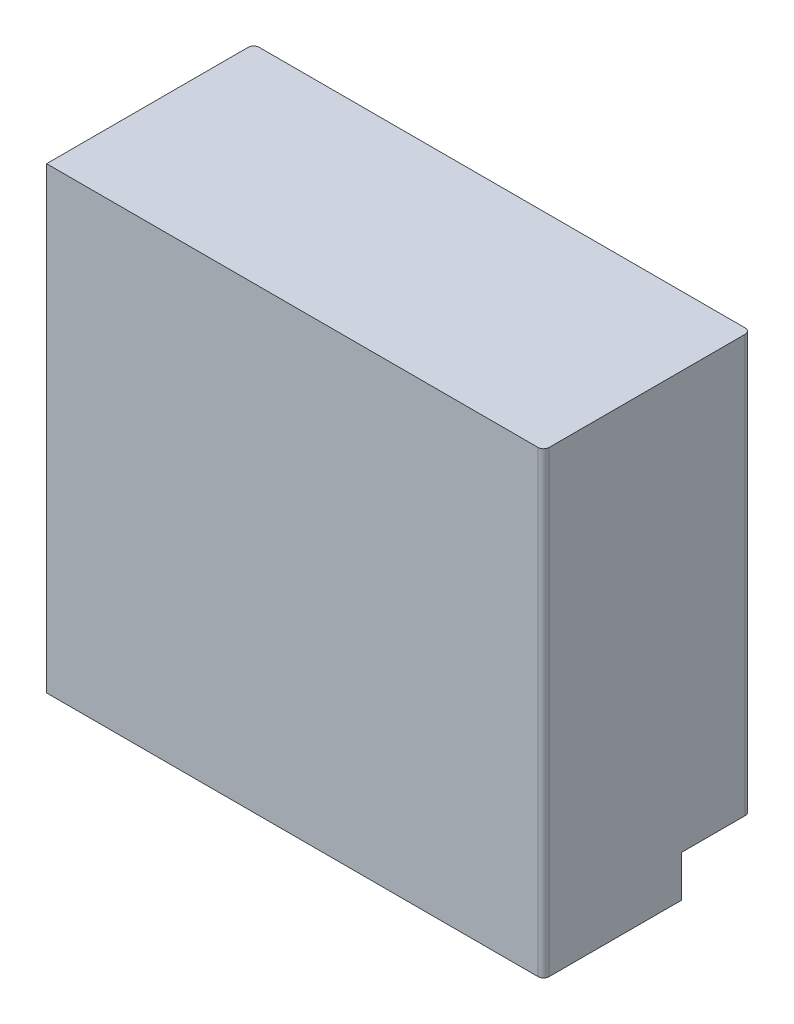
ISO-10303-21;
HEADER;
FILE_DESCRIPTION(('STEP AP214'),'2;1');
FILE_NAME('part.step','',(''),(''),'','','');
FILE_SCHEMA(('AUTOMOTIVE_DESIGN { 1 0 10303 214 1 1 1 1 }'));
ENDSEC;
DATA;
#1=APPLICATION_CONTEXT('core data for automotive mechanical design processes');
#2=APPLICATION_PROTOCOL_DEFINITION('international standard','automotive_design',2000,#1);
#3=PRODUCT_CONTEXT('',#1,'mechanical');
#4=PRODUCT('Part','Part','',(#3));
#5=PRODUCT_RELATED_PRODUCT_CATEGORY('part','',(#4));
#6=PRODUCT_DEFINITION_FORMATION('','',#4);
#7=PRODUCT_DEFINITION_CONTEXT('part definition',#1,'design');
#8=PRODUCT_DEFINITION('design','',#6,#7);
#9=PRODUCT_DEFINITION_SHAPE('','',#8);
#10=(LENGTH_UNIT() NAMED_UNIT(*) SI_UNIT(.MILLI.,.METRE.));
#11=(NAMED_UNIT(*) PLANE_ANGLE_UNIT() SI_UNIT($,.RADIAN.));
#12=(NAMED_UNIT(*) SI_UNIT($,.STERADIAN.) SOLID_ANGLE_UNIT());
#13=UNCERTAINTY_MEASURE_WITH_UNIT(LENGTH_MEASURE(1.E-05),#10,'distance_accuracy_value','');
#14=(GEOMETRIC_REPRESENTATION_CONTEXT(3) GLOBAL_UNCERTAINTY_ASSIGNED_CONTEXT((#13)) GLOBAL_UNIT_ASSIGNED_CONTEXT((#10,
#11,#12)) REPRESENTATION_CONTEXT('',''));
#15=CARTESIAN_POINT('',(0.,0.,0.));
#16=DIRECTION('',(0.,0.,1.));
#17=DIRECTION('',(1.,0.,0.));
#18=AXIS2_PLACEMENT_3D('',#15,#16,#17);
#19=CARTESIAN_POINT('',(0.,15.,0.));
#20=DIRECTION('',(0.,1.,0.));
#21=DIRECTION('',(0.,0.,1.));
#22=AXIS2_PLACEMENT_3D('',#19,#20,#21);
#23=PLANE('',#22);
#24=DIRECTION('',(1.,0.,0.));
#25=VECTOR('',#24,1.);
#26=CARTESIAN_POINT('',(90.,15.,-37.5));
#27=LINE('',#26,#25);
#28=CARTESIAN_POINT('',(40.,15.,-37.5));
#29=VERTEX_POINT('',#28);
#30=CARTESIAN_POINT('',(88.,15.,-37.5));
#31=VERTEX_POINT('',#30);
#32=EDGE_CURVE('E272',#29,#31,#27,.T.);
#33=ORIENTED_EDGE('',*,*,#32,.T.);
#34=CARTESIAN_POINT('',(88.,15.,-35.5));
#35=DIRECTION('',(0.,1.,0.));
#36=DIRECTION('',(0.,0.,1.));
#37=AXIS2_PLACEMENT_3D('',#34,#35,#36);
#38=CIRCLE('',#37,2.);
#39=CARTESIAN_POINT('',(90.,15.,-35.5));
#40=VERTEX_POINT('',#39);
#41=EDGE_CURVE('E375',#31,#40,#38,.F.);
#42=ORIENTED_EDGE('',*,*,#41,.T.);
#43=DIRECTION('',(0.,0.,1.));
#44=VECTOR('',#43,1.);
#45=CARTESIAN_POINT('',(90.,15.,-37.5));
#46=LINE('',#45,#44);
#47=CARTESIAN_POINT('',(90.,15.,-12.5));
#48=VERTEX_POINT('',#47);
#49=EDGE_CURVE('E275',#40,#48,#46,.T.);
#50=ORIENTED_EDGE('',*,*,#49,.T.);
#51=DIRECTION('',(-1.,0.,0.));
#52=VECTOR('',#51,1.);
#53=CARTESIAN_POINT('',(90.,15.,-12.5));
#54=LINE('',#53,#52);
#55=CARTESIAN_POINT('',(40.,15.,-12.5));
#56=VERTEX_POINT('',#55);
#57=EDGE_CURVE('E278',#48,#56,#54,.T.);
#58=ORIENTED_EDGE('',*,*,#57,.T.);
#59=DIRECTION('',(0.,0.,-1.));
#60=VECTOR('',#59,1.);
#61=CARTESIAN_POINT('',(40.,15.,-37.5));
#62=LINE('',#61,#60);
#63=EDGE_CURVE('E281',#56,#29,#62,.T.);
#64=ORIENTED_EDGE('',*,*,#63,.T.);
#65=EDGE_LOOP('',(#33,#42,#50,#58,#64));
#66=FACE_BOUND('',#65,.T.);
#67=DIRECTION('',(0.,0.,1.));
#68=VECTOR('',#67,1.);
#69=CARTESIAN_POINT('',(74.,15.,-17.5));
#70=LINE('',#69,#68);
#71=CARTESIAN_POINT('',(74.,15.,-32.4999999999999));
#72=VERTEX_POINT('',#71);
#73=CARTESIAN_POINT('',(74.,15.,-17.5));
#74=VERTEX_POINT('',#73);
#75=EDGE_CURVE('E213',#72,#74,#70,.T.);
#76=ORIENTED_EDGE('',*,*,#75,.F.);
#77=DIRECTION('',(1.,0.,0.));
#78=VECTOR('',#77,1.);
#79=CARTESIAN_POINT('',(74.,15.,-32.4999999999999));
#80=LINE('',#79,#78);
#81=CARTESIAN_POINT('',(70.,15.,-32.4999999999999));
#82=VERTEX_POINT('',#81);
#83=EDGE_CURVE('E225',#82,#72,#80,.T.);
#84=ORIENTED_EDGE('',*,*,#83,.F.);
#85=DIRECTION('',(0.,0.,-1.));
#86=VECTOR('',#85,1.);
#87=CARTESIAN_POINT('',(70.,15.,-17.5));
#88=LINE('',#87,#86);
#89=CARTESIAN_POINT('',(70.,15.,-17.5));
#90=VERTEX_POINT('',#89);
#91=EDGE_CURVE('E233',#90,#82,#88,.T.);
#92=ORIENTED_EDGE('',*,*,#91,.F.);
#93=DIRECTION('',(-1.,0.,0.));
#94=VECTOR('',#93,1.);
#95=CARTESIAN_POINT('',(74.,15.,-17.5));
#96=LINE('',#95,#94);
#97=EDGE_CURVE('E228',#74,#90,#96,.T.);
#98=ORIENTED_EDGE('',*,*,#97,.F.);
#99=EDGE_LOOP('',(#76,#84,#92,#98));
#100=FACE_BOUND('',#99,.T.);
#101=ADVANCED_FACE('F35',(#66,#100),#23,.F.);
#102=CARTESIAN_POINT('',(0.,15.,0.));
#103=DIRECTION('',(0.,1.,0.));
#104=DIRECTION('',(0.,0.,1.));
#105=AXIS2_PLACEMENT_3D('',#102,#103,#104);
#106=PLANE('',#105);
#107=DIRECTION('',(0.,0.,-1.));
#108=VECTOR('',#107,1.);
#109=CARTESIAN_POINT('',(-90.,15.,-37.5));
#110=LINE('',#109,#108);
#111=CARTESIAN_POINT('',(-90.,15.,-12.5));
#112=VERTEX_POINT('',#111);
#113=CARTESIAN_POINT('',(-90.,15.,-35.5));
#114=VERTEX_POINT('',#113);
#115=EDGE_CURVE('E297',#112,#114,#110,.T.);
#116=ORIENTED_EDGE('',*,*,#115,.T.);
#117=CARTESIAN_POINT('',(-88.,15.,-35.5));
#118=DIRECTION('',(0.,1.,0.));
#119=DIRECTION('',(0.,0.,1.));
#120=AXIS2_PLACEMENT_3D('',#117,#118,#119);
#121=CIRCLE('',#120,2.);
#122=CARTESIAN_POINT('',(-88.,15.,-37.5));
#123=VERTEX_POINT('',#122);
#124=EDGE_CURVE('E373',#114,#123,#121,.F.);
#125=ORIENTED_EDGE('',*,*,#124,.T.);
#126=DIRECTION('',(1.,0.,0.));
#127=VECTOR('',#126,1.);
#128=CARTESIAN_POINT('',(-90.,15.,-37.5));
#129=LINE('',#128,#127);
#130=CARTESIAN_POINT('',(-40.,15.,-37.5));
#131=VERTEX_POINT('',#130);
#132=EDGE_CURVE('E300',#123,#131,#129,.T.);
#133=ORIENTED_EDGE('',*,*,#132,.T.);
#134=DIRECTION('',(0.,0.,1.));
#135=VECTOR('',#134,1.);
#136=CARTESIAN_POINT('',(-40.,15.,-37.5));
#137=LINE('',#136,#135);
#138=CARTESIAN_POINT('',(-40.,15.,-12.5));
#139=VERTEX_POINT('',#138);
#140=EDGE_CURVE('E303',#131,#139,#137,.T.);
#141=ORIENTED_EDGE('',*,*,#140,.T.);
#142=DIRECTION('',(-1.,0.,0.));
#143=VECTOR('',#142,1.);
#144=CARTESIAN_POINT('',(-90.,15.,-12.5));
#145=LINE('',#144,#143);
#146=EDGE_CURVE('E306',#139,#112,#145,.T.);
#147=ORIENTED_EDGE('',*,*,#146,.T.);
#148=EDGE_LOOP('',(#116,#125,#133,#141,#147));
#149=FACE_BOUND('',#148,.T.);
#150=DIRECTION('',(0.,0.,-1.));
#151=VECTOR('',#150,1.);
#152=CARTESIAN_POINT('',(-74.,15.,-17.5));
#153=LINE('',#152,#151);
#154=CARTESIAN_POINT('',(-74.,15.,-17.5));
#155=VERTEX_POINT('',#154);
#156=CARTESIAN_POINT('',(-74.,15.,-32.5));
#157=VERTEX_POINT('',#156);
#158=EDGE_CURVE('E245',#155,#157,#153,.T.);
#159=ORIENTED_EDGE('',*,*,#158,.F.);
#160=DIRECTION('',(-1.,0.,0.));
#161=VECTOR('',#160,1.);
#162=CARTESIAN_POINT('',(-74.,15.,-17.5));
#163=LINE('',#162,#161);
#164=CARTESIAN_POINT('',(-70.,15.,-17.5));
#165=VERTEX_POINT('',#164);
#166=EDGE_CURVE('E250',#165,#155,#163,.T.);
#167=ORIENTED_EDGE('',*,*,#166,.F.);
#168=DIRECTION('',(0.,0.,1.));
#169=VECTOR('',#168,1.);
#170=CARTESIAN_POINT('',(-70.,15.,-17.5));
#171=LINE('',#170,#169);
#172=CARTESIAN_POINT('',(-70.,15.,-32.5));
#173=VERTEX_POINT('',#172);
#174=EDGE_CURVE('E259',#173,#165,#171,.T.);
#175=ORIENTED_EDGE('',*,*,#174,.F.);
#176=DIRECTION('',(1.,0.,0.));
#177=VECTOR('',#176,1.);
#178=CARTESIAN_POINT('',(-74.,15.,-32.5));
#179=LINE('',#178,#177);
#180=EDGE_CURVE('E256',#157,#173,#179,.T.);
#181=ORIENTED_EDGE('',*,*,#180,.F.);
#182=EDGE_LOOP('',(#159,#167,#175,#181));
#183=FACE_BOUND('',#182,.T.);
#184=ADVANCED_FACE('F421',(#149,#183),#106,.F.);
#185=CARTESIAN_POINT('',(-90.,166.,-37.5));
#186=DIRECTION('',(1.,0.,0.));
#187=DIRECTION('',(0.,0.,-1.));
#188=AXIS2_PLACEMENT_3D('',#185,#186,#187);
#189=PLANE('',#188);
#190=DIRECTION('',(0.,0.,1.));
#191=VECTOR('',#190,1.);
#192=CARTESIAN_POINT('',(-90.,166.,-37.5));
#193=LINE('',#192,#191);
#194=CARTESIAN_POINT('',(-90.,166.,-35.5));
#195=VERTEX_POINT('',#194);
#196=CARTESIAN_POINT('',(-90.,166.,37.5));
#197=VERTEX_POINT('',#196);
#198=EDGE_CURVE('E321',#195,#197,#193,.T.);
#199=ORIENTED_EDGE('',*,*,#198,.F.);
#200=DIRECTION('',(0.,-1.,0.));
#201=VECTOR('',#200,1.);
#202=CARTESIAN_POINT('',(-90.,166.,-35.5));
#203=LINE('',#202,#201);
#204=EDGE_CURVE('E370',#195,#114,#203,.T.);
#205=ORIENTED_EDGE('',*,*,#204,.T.);
#206=ORIENTED_EDGE('',*,*,#115,.F.);
#207=DIRECTION('',(0.,-1.,0.));
#208=VECTOR('',#207,1.);
#209=CARTESIAN_POINT('',(-90.,15.,-12.5));
#210=LINE('',#209,#208);
#211=CARTESIAN_POINT('',(-90.,0.,-12.5));
#212=VERTEX_POINT('',#211);
#213=EDGE_CURVE('E312',#112,#212,#210,.T.);
#214=ORIENTED_EDGE('',*,*,#213,.T.);
#215=DIRECTION('',(0.,0.,1.));
#216=VECTOR('',#215,1.);
#217=CARTESIAN_POINT('',(-90.,0.,-37.5));
#218=LINE('',#217,#216);
#219=CARTESIAN_POINT('',(-90.,0.,37.5));
#220=VERTEX_POINT('',#219);
#221=EDGE_CURVE('E315',#212,#220,#218,.T.);
#222=ORIENTED_EDGE('',*,*,#221,.T.);
#223=DIRECTION('',(0.,-1.,0.));
#224=VECTOR('',#223,1.);
#225=CARTESIAN_POINT('',(-90.,166.,37.5));
#226=LINE('',#225,#224);
#227=EDGE_CURVE('E333',#197,#220,#226,.T.);
#228=ORIENTED_EDGE('',*,*,#227,.F.);
#229=EDGE_LOOP('',(#199,#205,#206,#214,#222,#228));
#230=FACE_BOUND('',#229,.T.);
#231=ADVANCED_FACE('F440',(#230),#189,.F.);
#232=CARTESIAN_POINT('',(90.,166.,37.5));
#233=DIRECTION('',(0.,0.,-1.));
#234=DIRECTION('',(-1.,0.,0.));
#235=AXIS2_PLACEMENT_3D('',#232,#233,#234);
#236=PLANE('',#235);
#237=DIRECTION('',(1.,0.,0.));
#238=VECTOR('',#237,1.);
#239=CARTESIAN_POINT('',(90.,0.,37.5));
#240=LINE('',#239,#238);
#241=CARTESIAN_POINT('',(88.,0.,37.5));
#242=VERTEX_POINT('',#241);
#243=EDGE_CURVE('E335',#220,#242,#240,.T.);
#244=ORIENTED_EDGE('',*,*,#243,.T.);
#245=DIRECTION('',(0.,-1.,0.));
#246=VECTOR('',#245,1.);
#247=CARTESIAN_POINT('',(88.,166.,37.5));
#248=LINE('',#247,#246);
#249=CARTESIAN_POINT('',(88.,166.,37.5));
#250=VERTEX_POINT('',#249);
#251=EDGE_CURVE('E350',#242,#250,#248,.F.);
#252=ORIENTED_EDGE('',*,*,#251,.T.);
#253=DIRECTION('',(1.,0.,0.));
#254=VECTOR('',#253,1.);
#255=CARTESIAN_POINT('',(90.,166.,37.5));
#256=LINE('',#255,#254);
#257=EDGE_CURVE('E323',#197,#250,#256,.T.);
#258=ORIENTED_EDGE('',*,*,#257,.F.);
#259=ORIENTED_EDGE('',*,*,#227,.T.);
#260=EDGE_LOOP('',(#244,#252,#258,#259));
#261=FACE_BOUND('',#260,.T.);
#262=ADVANCED_FACE('F478',(#261),#236,.F.);
#263=CARTESIAN_POINT('',(90.,166.,-37.5));
#264=DIRECTION('',(-1.,0.,0.));
#265=DIRECTION('',(0.,0.,1.));
#266=AXIS2_PLACEMENT_3D('',#263,#264,#265);
#267=PLANE('',#266);
#268=DIRECTION('',(0.,0.,-1.));
#269=VECTOR('',#268,1.);
#270=CARTESIAN_POINT('',(90.,166.,-37.5));
#271=LINE('',#270,#269);
#272=CARTESIAN_POINT('',(90.,166.,35.5));
#273=VERTEX_POINT('',#272);
#274=CARTESIAN_POINT('',(90.,166.,-35.5));
#275=VERTEX_POINT('',#274);
#276=EDGE_CURVE('E327',#273,#275,#271,.T.);
#277=ORIENTED_EDGE('',*,*,#276,.F.);
#278=DIRECTION('',(0.,-1.,0.));
#279=VECTOR('',#278,1.);
#280=CARTESIAN_POINT('',(90.,166.,35.5));
#281=LINE('',#280,#279);
#282=CARTESIAN_POINT('',(90.,0.,35.5));
#283=VERTEX_POINT('',#282);
#284=EDGE_CURVE('E343',#273,#283,#281,.T.);
#285=ORIENTED_EDGE('',*,*,#284,.T.);
#286=DIRECTION('',(0.,0.,-1.));
#287=VECTOR('',#286,1.);
#288=CARTESIAN_POINT('',(90.,0.,-37.5));
#289=LINE('',#288,#287);
#290=CARTESIAN_POINT('',(90.,0.,-12.5));
#291=VERTEX_POINT('',#290);
#292=EDGE_CURVE('E324',#283,#291,#289,.T.);
#293=ORIENTED_EDGE('',*,*,#292,.T.);
#294=DIRECTION('',(0.,-1.,0.));
#295=VECTOR('',#294,1.);
#296=CARTESIAN_POINT('',(90.,15.,-12.5));
#297=LINE('',#296,#295);
#298=EDGE_CURVE('E284',#48,#291,#297,.T.);
#299=ORIENTED_EDGE('',*,*,#298,.F.);
#300=ORIENTED_EDGE('',*,*,#49,.F.);
#301=DIRECTION('',(0.,-1.,0.));
#302=VECTOR('',#301,1.);
#303=CARTESIAN_POINT('',(90.,166.,-35.5));
#304=LINE('',#303,#302);
#305=EDGE_CURVE('E341',#40,#275,#304,.F.);
#306=ORIENTED_EDGE('',*,*,#305,.T.);
#307=EDGE_LOOP('',(#277,#285,#293,#299,#300,#306));
#308=FACE_BOUND('',#307,.T.);
#309=ADVANCED_FACE('F474',(#308),#267,.F.);
#310=CARTESIAN_POINT('',(90.,166.,-37.5));
#311=DIRECTION('',(0.,0.,1.));
#312=DIRECTION('',(1.,0.,0.));
#313=AXIS2_PLACEMENT_3D('',#310,#311,#312);
#314=PLANE('',#313);
#315=DIRECTION('',(0.,-1.,0.));
#316=VECTOR('',#315,1.);
#317=CARTESIAN_POINT('',(40.,15.,-37.5));
#318=LINE('',#317,#316);
#319=CARTESIAN_POINT('',(40.,2.,-37.5));
#320=VERTEX_POINT('',#319);
#321=EDGE_CURVE('E289',#29,#320,#318,.T.);
#322=ORIENTED_EDGE('',*,*,#321,.T.);
#323=DIRECTION('',(-1.,0.,0.));
#324=VECTOR('',#323,1.);
#325=CARTESIAN_POINT('',(-40.,2.,-37.5));
#326=LINE('',#325,#324);
#327=CARTESIAN_POINT('',(-40.,2.,-37.5));
#328=VERTEX_POINT('',#327);
#329=EDGE_CURVE('E363',#320,#328,#326,.T.);
#330=ORIENTED_EDGE('',*,*,#329,.T.);
#331=DIRECTION('',(0.,-1.,0.));
#332=VECTOR('',#331,1.);
#333=CARTESIAN_POINT('',(-40.,15.,-37.5));
#334=LINE('',#333,#332);
#335=EDGE_CURVE('E309',#131,#328,#334,.T.);
#336=ORIENTED_EDGE('',*,*,#335,.F.);
#337=ORIENTED_EDGE('',*,*,#132,.F.);
#338=DIRECTION('',(0.,-1.,0.));
#339=VECTOR('',#338,1.);
#340=CARTESIAN_POINT('',(-88.,166.,-37.5));
#341=LINE('',#340,#339);
#342=CARTESIAN_POINT('',(-87.9999999999999,166.,-37.5));
#343=VERTEX_POINT('',#342);
#344=EDGE_CURVE('E361',#123,#343,#341,.F.);
#345=ORIENTED_EDGE('',*,*,#344,.T.);
#346=DIRECTION('',(-1.,0.,0.));
#347=VECTOR('',#346,1.);
#348=CARTESIAN_POINT('',(90.,166.,-37.5));
#349=LINE('',#348,#347);
#350=CARTESIAN_POINT('',(88.,166.,-37.5));
#351=VERTEX_POINT('',#350);
#352=EDGE_CURVE('E330',#351,#343,#349,.T.);
#353=ORIENTED_EDGE('',*,*,#352,.F.);
#354=DIRECTION('',(0.,-1.,0.));
#355=VECTOR('',#354,1.);
#356=CARTESIAN_POINT('',(88.,166.,-37.5));
#357=LINE('',#356,#355);
#358=EDGE_CURVE('E358',#351,#31,#357,.T.);
#359=ORIENTED_EDGE('',*,*,#358,.T.);
#360=ORIENTED_EDGE('',*,*,#32,.F.);
#361=EDGE_LOOP('',(#322,#330,#336,#337,#345,#353,#359,#360));
#362=FACE_BOUND('',#361,.T.);
#363=ADVANCED_FACE('F467',(#362),#314,.F.);
#364=CARTESIAN_POINT('',(0.,166.,0.));
#365=DIRECTION('',(0.,-1.,0.));
#366=DIRECTION('',(0.,0.,-1.));
#367=AXIS2_PLACEMENT_3D('',#364,#365,#366);
#368=PLANE('',#367);
#369=ORIENTED_EDGE('',*,*,#257,.T.);
#370=CARTESIAN_POINT('',(88.,166.,35.5));
#371=DIRECTION('',(0.,-1.,0.));
#372=DIRECTION('',(0.,0.,-1.));
#373=AXIS2_PLACEMENT_3D('',#370,#371,#372);
#374=CIRCLE('',#373,2.);
#375=EDGE_CURVE('E356',#250,#273,#374,.F.);
#376=ORIENTED_EDGE('',*,*,#375,.T.);
#377=ORIENTED_EDGE('',*,*,#276,.T.);
#378=CARTESIAN_POINT('',(88.,166.,-35.5));
#379=DIRECTION('',(0.,-1.,0.));
#380=DIRECTION('',(0.,0.,-1.));
#381=AXIS2_PLACEMENT_3D('',#378,#379,#380);
#382=CIRCLE('',#381,2.);
#383=EDGE_CURVE('E352',#275,#351,#382,.F.);
#384=ORIENTED_EDGE('',*,*,#383,.T.);
#385=ORIENTED_EDGE('',*,*,#352,.T.);
#386=CARTESIAN_POINT('',(-88.,166.,-35.5));
#387=DIRECTION('',(0.,-1.,0.));
#388=DIRECTION('',(0.,0.,-1.));
#389=AXIS2_PLACEMENT_3D('',#386,#387,#388);
#390=CIRCLE('',#389,2.);
#391=EDGE_CURVE('E354',#343,#195,#390,.F.);
#392=ORIENTED_EDGE('',*,*,#391,.T.);
#393=ORIENTED_EDGE('',*,*,#198,.T.);
#394=EDGE_LOOP('',(#369,#376,#377,#384,#385,#392,#393));
#395=FACE_BOUND('',#394,.T.);
#396=ADVANCED_FACE('F464',(#395),#368,.F.);
#397=CARTESIAN_POINT('',(0.,0.,0.));
#398=DIRECTION('',(0.,-1.,0.));
#399=DIRECTION('',(0.,0.,-1.));
#400=AXIS2_PLACEMENT_3D('',#397,#398,#399);
#401=PLANE('',#400);
#402=ORIENTED_EDGE('',*,*,#292,.F.);
#403=CARTESIAN_POINT('',(88.,0.,35.5));
#404=DIRECTION('',(0.,-1.,0.));
#405=DIRECTION('',(0.,0.,-1.));
#406=AXIS2_PLACEMENT_3D('',#403,#404,#405);
#407=CIRCLE('',#406,2.);
#408=EDGE_CURVE('E348',#283,#242,#407,.T.);
#409=ORIENTED_EDGE('',*,*,#408,.T.);
#410=ORIENTED_EDGE('',*,*,#243,.F.);
#411=ORIENTED_EDGE('',*,*,#221,.F.);
#412=DIRECTION('',(-1.,0.,0.));
#413=VECTOR('',#412,1.);
#414=CARTESIAN_POINT('',(-90.,0.,-12.5));
#415=LINE('',#414,#413);
#416=CARTESIAN_POINT('',(-40.,0.,-12.5));
#417=VERTEX_POINT('',#416);
#418=EDGE_CURVE('E301',#417,#212,#415,.T.);
#419=ORIENTED_EDGE('',*,*,#418,.F.);
#420=DIRECTION('',(0.,0.,1.));
#421=VECTOR('',#420,1.);
#422=CARTESIAN_POINT('',(-40.,0.,-37.5));
#423=LINE('',#422,#421);
#424=CARTESIAN_POINT('',(-40.,0.,-35.5));
#425=VERTEX_POINT('',#424);
#426=EDGE_CURVE('E292',#425,#417,#423,.T.);
#427=ORIENTED_EDGE('',*,*,#426,.F.);
#428=DIRECTION('',(-1.,0.,0.));
#429=VECTOR('',#428,1.);
#430=CARTESIAN_POINT('',(40.,0.,-35.5));
#431=LINE('',#430,#429);
#432=CARTESIAN_POINT('',(40.,0.,-35.5));
#433=VERTEX_POINT('',#432);
#434=EDGE_CURVE('E346',#425,#433,#431,.F.);
#435=ORIENTED_EDGE('',*,*,#434,.T.);
#436=DIRECTION('',(0.,0.,-1.));
#437=VECTOR('',#436,1.);
#438=CARTESIAN_POINT('',(40.,0.,-37.5));
#439=LINE('',#438,#437);
#440=CARTESIAN_POINT('',(40.,0.,-12.5));
#441=VERTEX_POINT('',#440);
#442=EDGE_CURVE('E276',#441,#433,#439,.T.);
#443=ORIENTED_EDGE('',*,*,#442,.F.);
#444=DIRECTION('',(-1.,0.,0.));
#445=VECTOR('',#444,1.);
#446=CARTESIAN_POINT('',(90.,0.,-12.5));
#447=LINE('',#446,#445);
#448=EDGE_CURVE('E271',#291,#441,#447,.T.);
#449=ORIENTED_EDGE('',*,*,#448,.F.);
#450=EDGE_LOOP('',(#402,#409,#410,#411,#419,#427,#435,#443,#449));
#451=FACE_BOUND('',#450,.T.);
#452=ADVANCED_FACE('F459',(#451),#401,.T.);
#453=CARTESIAN_POINT('',(-90.,15.,-12.5));
#454=DIRECTION('',(0.,0.,1.));
#455=DIRECTION('',(1.,0.,0.));
#456=AXIS2_PLACEMENT_3D('',#453,#454,#455);
#457=PLANE('',#456);
#458=ORIENTED_EDGE('',*,*,#418,.T.);
#459=ORIENTED_EDGE('',*,*,#213,.F.);
#460=ORIENTED_EDGE('',*,*,#146,.F.);
#461=DIRECTION('',(0.,-1.,0.));
#462=VECTOR('',#461,1.);
#463=CARTESIAN_POINT('',(-40.,15.,-12.5));
#464=LINE('',#463,#462);
#465=EDGE_CURVE('E316',#139,#417,#464,.T.);
#466=ORIENTED_EDGE('',*,*,#465,.T.);
#467=EDGE_LOOP('',(#458,#459,#460,#466));
#468=FACE_BOUND('',#467,.T.);
#469=ADVANCED_FACE('F456',(#468),#457,.F.);
#470=CARTESIAN_POINT('',(-40.,15.,-37.5));
#471=DIRECTION('',(1.,0.,0.));
#472=DIRECTION('',(0.,0.,-1.));
#473=AXIS2_PLACEMENT_3D('',#470,#471,#472);
#474=PLANE('',#473);
#475=ORIENTED_EDGE('',*,*,#335,.T.);
#476=CARTESIAN_POINT('',(-40.,2.,-35.5));
#477=DIRECTION('',(1.,0.,0.));
#478=DIRECTION('',(0.,0.,-1.));
#479=AXIS2_PLACEMENT_3D('',#476,#477,#478);
#480=CIRCLE('',#479,2.);
#481=EDGE_CURVE('E366',#328,#425,#480,.F.);
#482=ORIENTED_EDGE('',*,*,#481,.T.);
#483=ORIENTED_EDGE('',*,*,#426,.T.);
#484=ORIENTED_EDGE('',*,*,#465,.F.);
#485=ORIENTED_EDGE('',*,*,#140,.F.);
#486=EDGE_LOOP('',(#475,#482,#483,#484,#485));
#487=FACE_BOUND('',#486,.T.);
#488=ADVANCED_FACE('F450',(#487),#474,.F.);
#489=CARTESIAN_POINT('',(40.,15.,-37.5));
#490=DIRECTION('',(-1.,0.,0.));
#491=DIRECTION('',(0.,0.,1.));
#492=AXIS2_PLACEMENT_3D('',#489,#490,#491);
#493=PLANE('',#492);
#494=ORIENTED_EDGE('',*,*,#442,.T.);
#495=CARTESIAN_POINT('',(40.,2.,-35.5));
#496=DIRECTION('',(-1.,0.,0.));
#497=DIRECTION('',(0.,0.,1.));
#498=AXIS2_PLACEMENT_3D('',#495,#496,#497);
#499=CIRCLE('',#498,2.);
#500=EDGE_CURVE('E368',#433,#320,#499,.F.);
#501=ORIENTED_EDGE('',*,*,#500,.T.);
#502=ORIENTED_EDGE('',*,*,#321,.F.);
#503=ORIENTED_EDGE('',*,*,#63,.F.);
#504=DIRECTION('',(0.,-1.,0.));
#505=VECTOR('',#504,1.);
#506=CARTESIAN_POINT('',(40.,15.,-12.5));
#507=LINE('',#506,#505);
#508=EDGE_CURVE('E293',#56,#441,#507,.T.);
#509=ORIENTED_EDGE('',*,*,#508,.T.);
#510=EDGE_LOOP('',(#494,#501,#502,#503,#509));
#511=FACE_BOUND('',#510,.T.);
#512=ADVANCED_FACE('F446',(#511),#493,.F.);
#513=CARTESIAN_POINT('',(90.,15.,-12.5));
#514=DIRECTION('',(0.,0.,1.));
#515=DIRECTION('',(1.,0.,0.));
#516=AXIS2_PLACEMENT_3D('',#513,#514,#515);
#517=PLANE('',#516);
#518=ORIENTED_EDGE('',*,*,#448,.T.);
#519=ORIENTED_EDGE('',*,*,#508,.F.);
#520=ORIENTED_EDGE('',*,*,#57,.F.);
#521=ORIENTED_EDGE('',*,*,#298,.T.);
#522=EDGE_LOOP('',(#518,#519,#520,#521));
#523=FACE_BOUND('',#522,.T.);
#524=ADVANCED_FACE('F449',(#523),#517,.F.);
#525=CARTESIAN_POINT('',(88.,166.,35.5));
#526=DIRECTION('',(0.,-1.,0.));
#527=DIRECTION('',(0.,0.,-1.));
#528=AXIS2_PLACEMENT_3D('',#525,#526,#527);
#529=CYLINDRICAL_SURFACE('',#528,2.);
#530=ORIENTED_EDGE('',*,*,#375,.F.);
#531=ORIENTED_EDGE('',*,*,#251,.F.);
#532=ORIENTED_EDGE('',*,*,#408,.F.);
#533=ORIENTED_EDGE('',*,*,#284,.F.);
#534=EDGE_LOOP('',(#530,#531,#532,#533));
#535=FACE_BOUND('',#534,.T.);
#536=ADVANCED_FACE('F453',(#535),#529,.T.);
#537=CARTESIAN_POINT('',(90.,2.,-35.5));
#538=DIRECTION('',(1.,0.,0.));
#539=DIRECTION('',(0.,0.,-1.));
#540=AXIS2_PLACEMENT_3D('',#537,#538,#539);
#541=CYLINDRICAL_SURFACE('',#540,2.);
#542=ORIENTED_EDGE('',*,*,#500,.F.);
#543=ORIENTED_EDGE('',*,*,#434,.F.);
#544=ORIENTED_EDGE('',*,*,#481,.F.);
#545=ORIENTED_EDGE('',*,*,#329,.F.);
#546=EDGE_LOOP('',(#542,#543,#544,#545));
#547=FACE_BOUND('',#546,.T.);
#548=ADVANCED_FACE('F488',(#547),#541,.T.);
#549=CARTESIAN_POINT('',(-88.,166.,-35.5));
#550=DIRECTION('',(0.,-1.,0.));
#551=DIRECTION('',(0.,0.,-1.));
#552=AXIS2_PLACEMENT_3D('',#549,#550,#551);
#553=CYLINDRICAL_SURFACE('',#552,2.);
#554=ORIENTED_EDGE('',*,*,#391,.F.);
#555=ORIENTED_EDGE('',*,*,#344,.F.);
#556=ORIENTED_EDGE('',*,*,#124,.F.);
#557=ORIENTED_EDGE('',*,*,#204,.F.);
#558=EDGE_LOOP('',(#554,#555,#556,#557));
#559=FACE_BOUND('',#558,.T.);
#560=ADVANCED_FACE('F492',(#559),#553,.T.);
#561=CARTESIAN_POINT('',(88.,166.,-35.5));
#562=DIRECTION('',(0.,-1.,0.));
#563=DIRECTION('',(0.,0.,-1.));
#564=AXIS2_PLACEMENT_3D('',#561,#562,#563);
#565=CYLINDRICAL_SURFACE('',#564,2.);
#566=ORIENTED_EDGE('',*,*,#383,.F.);
#567=ORIENTED_EDGE('',*,*,#305,.F.);
#568=ORIENTED_EDGE('',*,*,#41,.F.);
#569=ORIENTED_EDGE('',*,*,#358,.F.);
#570=EDGE_LOOP('',(#566,#567,#568,#569));
#571=FACE_BOUND('',#570,.T.);
#572=ADVANCED_FACE('F496',(#571),#565,.T.);
#573=CARTESIAN_POINT('',(-74.,0.999999999999999,-17.5));
#574=DIRECTION('',(1.,0.,0.));
#575=DIRECTION('',(0.,0.,-1.));
#576=AXIS2_PLACEMENT_3D('',#573,#574,#575);
#577=PLANE('',#576);
#578=DIRECTION('',(0.,0.,-1.));
#579=VECTOR('',#578,1.);
#580=CARTESIAN_POINT('',(-74.,0.999999999999999,-17.5));
#581=LINE('',#580,#579);
#582=CARTESIAN_POINT('',(-74.,0.999999999999999,-21.5));
#583=VERTEX_POINT('',#582);
#584=CARTESIAN_POINT('',(-74.,0.999999999999999,-28.5));
#585=VERTEX_POINT('',#584);
#586=EDGE_CURVE('E246',#583,#585,#581,.T.);
#587=ORIENTED_EDGE('',*,*,#586,.F.);
#588=CARTESIAN_POINT('',(-74.,5.,-21.5));
#589=DIRECTION('',(1.,0.,0.));
#590=DIRECTION('',(0.,0.,-1.));
#591=AXIS2_PLACEMENT_3D('',#588,#589,#590);
#592=CIRCLE('',#591,4.);
#593=CARTESIAN_POINT('',(-74.,5.,-17.5));
#594=VERTEX_POINT('',#593);
#595=EDGE_CURVE('E402',#583,#594,#592,.F.);
#596=ORIENTED_EDGE('',*,*,#595,.T.);
#597=DIRECTION('',(0.,1.,0.));
#598=VECTOR('',#597,1.);
#599=CARTESIAN_POINT('',(-74.,0.999999999999999,-17.5));
#600=LINE('',#599,#598);
#601=EDGE_CURVE('E253',#594,#155,#600,.T.);
#602=ORIENTED_EDGE('',*,*,#601,.T.);
#603=ORIENTED_EDGE('',*,*,#158,.T.);
#604=DIRECTION('',(0.,1.,0.));
#605=VECTOR('',#604,1.);
#606=CARTESIAN_POINT('',(-74.,0.999999999999999,-32.5));
#607=LINE('',#606,#605);
#608=CARTESIAN_POINT('',(-74.,5.,-32.5));
#609=VERTEX_POINT('',#608);
#610=EDGE_CURVE('E269',#609,#157,#607,.T.);
#611=ORIENTED_EDGE('',*,*,#610,.F.);
#612=CARTESIAN_POINT('',(-74.,5.,-28.5));
#613=DIRECTION('',(1.,0.,0.));
#614=DIRECTION('',(0.,0.,-1.));
#615=AXIS2_PLACEMENT_3D('',#612,#613,#614);
#616=CIRCLE('',#615,4.);
#617=EDGE_CURVE('E400',#609,#585,#616,.F.);
#618=ORIENTED_EDGE('',*,*,#617,.T.);
#619=EDGE_LOOP('',(#587,#596,#602,#603,#611,#618));
#620=FACE_BOUND('',#619,.T.);
#621=ADVANCED_FACE('F415',(#620),#577,.F.);
#622=CARTESIAN_POINT('',(-74.,0.999999999999999,-32.5));
#623=DIRECTION('',(0.,0.,1.));
#624=DIRECTION('',(1.,0.,0.));
#625=AXIS2_PLACEMENT_3D('',#622,#623,#624);
#626=PLANE('',#625);
#627=DIRECTION('',(0.,1.,0.));
#628=VECTOR('',#627,1.);
#629=CARTESIAN_POINT('',(-70.,0.999999999999999,-32.5));
#630=LINE('',#629,#628);
#631=CARTESIAN_POINT('',(-70.,5.,-32.5));
#632=VERTEX_POINT('',#631);
#633=EDGE_CURVE('E267',#632,#173,#630,.T.);
#634=ORIENTED_EDGE('',*,*,#633,.F.);
#635=DIRECTION('',(1.,0.,0.));
#636=VECTOR('',#635,1.);
#637=CARTESIAN_POINT('',(-74.,5.,-32.5));
#638=LINE('',#637,#636);
#639=EDGE_CURVE('E11',#632,#609,#638,.F.);
#640=ORIENTED_EDGE('',*,*,#639,.T.);
#641=ORIENTED_EDGE('',*,*,#610,.T.);
#642=ORIENTED_EDGE('',*,*,#180,.T.);
#643=EDGE_LOOP('',(#634,#640,#641,#642));
#644=FACE_BOUND('',#643,.T.);
#645=ADVANCED_FACE('F425',(#644),#626,.F.);
#646=CARTESIAN_POINT('',(-70.,0.999999999999999,-17.5));
#647=DIRECTION('',(-1.,0.,0.));
#648=DIRECTION('',(0.,0.,1.));
#649=AXIS2_PLACEMENT_3D('',#646,#647,#648);
#650=PLANE('',#649);
#651=DIRECTION('',(0.,1.,0.));
#652=VECTOR('',#651,1.);
#653=CARTESIAN_POINT('',(-70.,0.999999999999999,-17.5));
#654=LINE('',#653,#652);
#655=CARTESIAN_POINT('',(-70.,5.,-17.5));
#656=VERTEX_POINT('',#655);
#657=EDGE_CURVE('E265',#656,#165,#654,.T.);
#658=ORIENTED_EDGE('',*,*,#657,.F.);
#659=CARTESIAN_POINT('',(-70.,5.,-21.5));
#660=DIRECTION('',(-1.,0.,0.));
#661=DIRECTION('',(0.,0.,1.));
#662=AXIS2_PLACEMENT_3D('',#659,#660,#661);
#663=CIRCLE('',#662,4.);
#664=CARTESIAN_POINT('',(-70.,0.999999999999999,-21.5));
#665=VERTEX_POINT('',#664);
#666=EDGE_CURVE('E43',#656,#665,#663,.F.);
#667=ORIENTED_EDGE('',*,*,#666,.T.);
#668=DIRECTION('',(0.,0.,1.));
#669=VECTOR('',#668,1.);
#670=CARTESIAN_POINT('',(-70.,0.999999999999999,-17.5));
#671=LINE('',#670,#669);
#672=CARTESIAN_POINT('',(-70.,0.999999999999999,-28.5));
#673=VERTEX_POINT('',#672);
#674=EDGE_CURVE('E249',#673,#665,#671,.T.);
#675=ORIENTED_EDGE('',*,*,#674,.F.);
#676=CARTESIAN_POINT('',(-70.,5.,-28.5));
#677=DIRECTION('',(-1.,0.,0.));
#678=DIRECTION('',(0.,0.,1.));
#679=AXIS2_PLACEMENT_3D('',#676,#677,#678);
#680=CIRCLE('',#679,4.);
#681=EDGE_CURVE('E50',#673,#632,#680,.F.);
#682=ORIENTED_EDGE('',*,*,#681,.T.);
#683=ORIENTED_EDGE('',*,*,#633,.T.);
#684=ORIENTED_EDGE('',*,*,#174,.T.);
#685=EDGE_LOOP('',(#658,#667,#675,#682,#683,#684));
#686=FACE_BOUND('',#685,.T.);
#687=ADVANCED_FACE('F406',(#686),#650,.F.);
#688=CARTESIAN_POINT('',(-74.,0.999999999999999,-17.5));
#689=DIRECTION('',(0.,0.,-1.));
#690=DIRECTION('',(-1.,0.,0.));
#691=AXIS2_PLACEMENT_3D('',#688,#689,#690);
#692=PLANE('',#691);
#693=ORIENTED_EDGE('',*,*,#601,.F.);
#694=DIRECTION('',(-1.,0.,0.));
#695=VECTOR('',#694,1.);
#696=CARTESIAN_POINT('',(-70.,5.,-17.5));
#697=LINE('',#696,#695);
#698=EDGE_CURVE('E58',#594,#656,#697,.F.);
#699=ORIENTED_EDGE('',*,*,#698,.T.);
#700=ORIENTED_EDGE('',*,*,#657,.T.);
#701=ORIENTED_EDGE('',*,*,#166,.T.);
#702=EDGE_LOOP('',(#693,#699,#700,#701));
#703=FACE_BOUND('',#702,.T.);
#704=ADVANCED_FACE('F417',(#703),#692,.F.);
#705=CARTESIAN_POINT('',(0.,0.999999999999999,0.));
#706=DIRECTION('',(0.,-1.,0.));
#707=DIRECTION('',(0.,0.,-1.));
#708=AXIS2_PLACEMENT_3D('',#705,#706,#707);
#709=PLANE('',#708);
#710=ORIENTED_EDGE('',*,*,#674,.T.);
#711=DIRECTION('',(-1.,0.,0.));
#712=VECTOR('',#711,1.);
#713=CARTESIAN_POINT('',(-74.,0.999999999999999,-21.5));
#714=LINE('',#713,#712);
#715=EDGE_CURVE('E397',#665,#583,#714,.T.);
#716=ORIENTED_EDGE('',*,*,#715,.T.);
#717=ORIENTED_EDGE('',*,*,#586,.T.);
#718=DIRECTION('',(1.,0.,0.));
#719=VECTOR('',#718,1.);
#720=CARTESIAN_POINT('',(-70.,0.999999999999999,-28.5));
#721=LINE('',#720,#719);
#722=EDGE_CURVE('E394',#585,#673,#721,.T.);
#723=ORIENTED_EDGE('',*,*,#722,.T.);
#724=EDGE_LOOP('',(#710,#716,#717,#723));
#725=FACE_BOUND('',#724,.T.);
#726=ADVANCED_FACE('F410',(#725),#709,.T.);
#727=CARTESIAN_POINT('',(74.,0.999999999999999,-17.5));
#728=DIRECTION('',(-1.,0.,0.));
#729=DIRECTION('',(0.,0.,1.));
#730=AXIS2_PLACEMENT_3D('',#727,#728,#729);
#731=PLANE('',#730);
#732=DIRECTION('',(0.,0.,1.));
#733=VECTOR('',#732,1.);
#734=CARTESIAN_POINT('',(74.,0.999999999999999,-17.5));
#735=LINE('',#734,#733);
#736=CARTESIAN_POINT('',(74.,0.999999999999999,-28.4999999999999));
#737=VERTEX_POINT('',#736);
#738=CARTESIAN_POINT('',(74.,0.999999999999999,-21.5));
#739=VERTEX_POINT('',#738);
#740=EDGE_CURVE('E232',#737,#739,#735,.T.);
#741=ORIENTED_EDGE('',*,*,#740,.F.);
#742=CARTESIAN_POINT('',(74.,5.,-28.4999999999999));
#743=DIRECTION('',(-1.,0.,0.));
#744=DIRECTION('',(0.,0.,1.));
#745=AXIS2_PLACEMENT_3D('',#742,#743,#744);
#746=CIRCLE('',#745,4.);
#747=CARTESIAN_POINT('',(74.,5.,-32.4999999999999));
#748=VERTEX_POINT('',#747);
#749=EDGE_CURVE('E214',#737,#748,#746,.F.);
#750=ORIENTED_EDGE('',*,*,#749,.T.);
#751=DIRECTION('',(0.,1.,0.));
#752=VECTOR('',#751,1.);
#753=CARTESIAN_POINT('',(74.,0.999999999999999,-32.4999999999999));
#754=LINE('',#753,#752);
#755=EDGE_CURVE('E208',#748,#72,#754,.T.);
#756=ORIENTED_EDGE('',*,*,#755,.T.);
#757=ORIENTED_EDGE('',*,*,#75,.T.);
#758=DIRECTION('',(0.,1.,0.));
#759=VECTOR('',#758,1.);
#760=CARTESIAN_POINT('',(74.,0.999999999999999,-17.5));
#761=LINE('',#760,#759);
#762=CARTESIAN_POINT('',(74.,5.,-17.5));
#763=VERTEX_POINT('',#762);
#764=EDGE_CURVE('E243',#763,#74,#761,.T.);
#765=ORIENTED_EDGE('',*,*,#764,.F.);
#766=CARTESIAN_POINT('',(74.,5.,-21.5));
#767=DIRECTION('',(-1.,0.,0.));
#768=DIRECTION('',(0.,0.,1.));
#769=AXIS2_PLACEMENT_3D('',#766,#767,#768);
#770=CIRCLE('',#769,4.);
#771=EDGE_CURVE('E383',#763,#739,#770,.F.);
#772=ORIENTED_EDGE('',*,*,#771,.T.);
#773=EDGE_LOOP('',(#741,#750,#756,#757,#765,#772));
#774=FACE_BOUND('',#773,.T.);
#775=ADVANCED_FACE('F211',(#774),#731,.F.);
#776=CARTESIAN_POINT('',(74.,0.999999999999999,-17.5));
#777=DIRECTION('',(0.,0.,-1.));
#778=DIRECTION('',(-1.,0.,0.));
#779=AXIS2_PLACEMENT_3D('',#776,#777,#778);
#780=PLANE('',#779);
#781=DIRECTION('',(0.,1.,0.));
#782=VECTOR('',#781,1.);
#783=CARTESIAN_POINT('',(70.,0.999999999999999,-17.5));
#784=LINE('',#783,#782);
#785=CARTESIAN_POINT('',(70.,5.,-17.5));
#786=VERTEX_POINT('',#785);
#787=EDGE_CURVE('E241',#786,#90,#784,.T.);
#788=ORIENTED_EDGE('',*,*,#787,.F.);
#789=DIRECTION('',(-1.,0.,0.));
#790=VECTOR('',#789,1.);
#791=CARTESIAN_POINT('',(74.,5.,-17.5));
#792=LINE('',#791,#790);
#793=EDGE_CURVE('E392',#786,#763,#792,.F.);
#794=ORIENTED_EDGE('',*,*,#793,.T.);
#795=ORIENTED_EDGE('',*,*,#764,.T.);
#796=ORIENTED_EDGE('',*,*,#97,.T.);
#797=EDGE_LOOP('',(#788,#794,#795,#796));
#798=FACE_BOUND('',#797,.T.);
#799=ADVANCED_FACE('F522',(#798),#780,.F.);
#800=CARTESIAN_POINT('',(70.,0.999999999999999,-17.5));
#801=DIRECTION('',(1.,0.,0.));
#802=DIRECTION('',(0.,0.,-1.));
#803=AXIS2_PLACEMENT_3D('',#800,#801,#802);
#804=PLANE('',#803);
#805=DIRECTION('',(0.,1.,0.));
#806=VECTOR('',#805,1.);
#807=CARTESIAN_POINT('',(70.,0.999999999999999,-32.4999999999999));
#808=LINE('',#807,#806);
#809=CARTESIAN_POINT('',(70.,5.,-32.4999999999999));
#810=VERTEX_POINT('',#809);
#811=EDGE_CURVE('E218',#810,#82,#808,.T.);
#812=ORIENTED_EDGE('',*,*,#811,.F.);
#813=CARTESIAN_POINT('',(70.,5.,-28.4999999999999));
#814=DIRECTION('',(1.,0.,0.));
#815=DIRECTION('',(0.,0.,-1.));
#816=AXIS2_PLACEMENT_3D('',#813,#814,#815);
#817=CIRCLE('',#816,4.);
#818=CARTESIAN_POINT('',(70.,0.999999999999999,-28.4999999999999));
#819=VERTEX_POINT('',#818);
#820=EDGE_CURVE('E390',#810,#819,#817,.F.);
#821=ORIENTED_EDGE('',*,*,#820,.T.);
#822=DIRECTION('',(0.,0.,-1.));
#823=VECTOR('',#822,1.);
#824=CARTESIAN_POINT('',(70.,0.999999999999999,-17.5));
#825=LINE('',#824,#823);
#826=CARTESIAN_POINT('',(70.,0.999999999999999,-21.5));
#827=VERTEX_POINT('',#826);
#828=EDGE_CURVE('E219',#827,#819,#825,.T.);
#829=ORIENTED_EDGE('',*,*,#828,.F.);
#830=CARTESIAN_POINT('',(70.,5.,-21.5));
#831=DIRECTION('',(1.,0.,0.));
#832=DIRECTION('',(0.,0.,-1.));
#833=AXIS2_PLACEMENT_3D('',#830,#831,#832);
#834=CIRCLE('',#833,4.);
#835=EDGE_CURVE('E388',#827,#786,#834,.F.);
#836=ORIENTED_EDGE('',*,*,#835,.T.);
#837=ORIENTED_EDGE('',*,*,#787,.T.);
#838=ORIENTED_EDGE('',*,*,#91,.T.);
#839=EDGE_LOOP('',(#812,#821,#829,#836,#837,#838));
#840=FACE_BOUND('',#839,.T.);
#841=ADVANCED_FACE('F519',(#840),#804,.F.);
#842=CARTESIAN_POINT('',(74.,0.999999999999999,-32.4999999999999));
#843=DIRECTION('',(0.,0.,1.));
#844=DIRECTION('',(1.,0.,0.));
#845=AXIS2_PLACEMENT_3D('',#842,#843,#844);
#846=PLANE('',#845);
#847=ORIENTED_EDGE('',*,*,#755,.F.);
#848=DIRECTION('',(1.,0.,0.));
#849=VECTOR('',#848,1.);
#850=CARTESIAN_POINT('',(74.,5.,-32.4999999999999));
#851=LINE('',#850,#849);
#852=EDGE_CURVE('E386',#748,#810,#851,.F.);
#853=ORIENTED_EDGE('',*,*,#852,.T.);
#854=ORIENTED_EDGE('',*,*,#811,.T.);
#855=ORIENTED_EDGE('',*,*,#83,.T.);
#856=EDGE_LOOP('',(#847,#853,#854,#855));
#857=FACE_BOUND('',#856,.T.);
#858=ADVANCED_FACE('F230',(#857),#846,.F.);
#859=CARTESIAN_POINT('',(0.,0.999999999999999,0.));
#860=DIRECTION('',(0.,1.,0.));
#861=DIRECTION('',(0.,0.,1.));
#862=AXIS2_PLACEMENT_3D('',#859,#860,#861);
#863=PLANE('',#862);
#864=ORIENTED_EDGE('',*,*,#828,.T.);
#865=DIRECTION('',(1.,0.,0.));
#866=VECTOR('',#865,1.);
#867=CARTESIAN_POINT('',(0.,0.999999999999999,-28.4999999999999));
#868=LINE('',#867,#866);
#869=EDGE_CURVE('E380',#819,#737,#868,.T.);
#870=ORIENTED_EDGE('',*,*,#869,.T.);
#871=ORIENTED_EDGE('',*,*,#740,.T.);
#872=DIRECTION('',(-1.,0.,0.));
#873=VECTOR('',#872,1.);
#874=CARTESIAN_POINT('',(0.,0.999999999999999,-21.5));
#875=LINE('',#874,#873);
#876=EDGE_CURVE('E377',#739,#827,#875,.T.);
#877=ORIENTED_EDGE('',*,*,#876,.T.);
#878=EDGE_LOOP('',(#864,#870,#871,#877));
#879=FACE_BOUND('',#878,.T.);
#880=ADVANCED_FACE('F504',(#879),#863,.F.);
#881=CARTESIAN_POINT('',(0.,5.,-28.4999999999999));
#882=DIRECTION('',(1.,0.,0.));
#883=DIRECTION('',(0.,0.,-1.));
#884=AXIS2_PLACEMENT_3D('',#881,#882,#883);
#885=CYLINDRICAL_SURFACE('',#884,4.);
#886=ORIENTED_EDGE('',*,*,#820,.F.);
#887=ORIENTED_EDGE('',*,*,#852,.F.);
#888=ORIENTED_EDGE('',*,*,#749,.F.);
#889=ORIENTED_EDGE('',*,*,#869,.F.);
#890=EDGE_LOOP('',(#886,#887,#888,#889));
#891=FACE_BOUND('',#890,.T.);
#892=ADVANCED_FACE('F501',(#891),#885,.T.);
#893=CARTESIAN_POINT('',(0.,5.,-21.5));
#894=DIRECTION('',(-1.,0.,0.));
#895=DIRECTION('',(0.,0.,1.));
#896=AXIS2_PLACEMENT_3D('',#893,#894,#895);
#897=CYLINDRICAL_SURFACE('',#896,4.);
#898=ORIENTED_EDGE('',*,*,#771,.F.);
#899=ORIENTED_EDGE('',*,*,#793,.F.);
#900=ORIENTED_EDGE('',*,*,#835,.F.);
#901=ORIENTED_EDGE('',*,*,#876,.F.);
#902=EDGE_LOOP('',(#898,#899,#900,#901));
#903=FACE_BOUND('',#902,.T.);
#904=ADVANCED_FACE('F433',(#903),#897,.T.);
#905=CARTESIAN_POINT('',(0.,5.,-21.5));
#906=DIRECTION('',(1.,0.,0.));
#907=DIRECTION('',(0.,0.,-1.));
#908=AXIS2_PLACEMENT_3D('',#905,#906,#907);
#909=CYLINDRICAL_SURFACE('',#908,4.);
#910=ORIENTED_EDGE('',*,*,#666,.F.);
#911=ORIENTED_EDGE('',*,*,#698,.F.);
#912=ORIENTED_EDGE('',*,*,#595,.F.);
#913=ORIENTED_EDGE('',*,*,#715,.F.);
#914=EDGE_LOOP('',(#910,#911,#912,#913));
#915=FACE_BOUND('',#914,.T.);
#916=ADVANCED_FACE('F413',(#915),#909,.T.);
#917=CARTESIAN_POINT('',(0.,5.,-28.5));
#918=DIRECTION('',(-1.,0.,0.));
#919=DIRECTION('',(0.,0.,1.));
#920=AXIS2_PLACEMENT_3D('',#917,#918,#919);
#921=CYLINDRICAL_SURFACE('',#920,4.);
#922=ORIENTED_EDGE('',*,*,#617,.F.);
#923=ORIENTED_EDGE('',*,*,#639,.F.);
#924=ORIENTED_EDGE('',*,*,#681,.F.);
#925=ORIENTED_EDGE('',*,*,#722,.F.);
#926=EDGE_LOOP('',(#922,#923,#924,#925));
#927=FACE_BOUND('',#926,.T.);
#928=ADVANCED_FACE('F37',(#927),#921,.T.);
#929=CLOSED_SHELL('',(#101,#184,#231,#262,#309,#363,#396,#452,#469,#488,#512,#524,#536,#548,
#560,#572,#621,#645,#687,#704,#726,#775,#799,#841,#858,#880,#892,#904,#916,#928));
#930=MANIFOLD_SOLID_BREP('B2',#929);
#931=ADVANCED_BREP_SHAPE_REPRESENTATION('',(#18,#930),#14);
#932=SHAPE_DEFINITION_REPRESENTATION(#9,#931);
ENDSEC;
END-ISO-10303-21;
